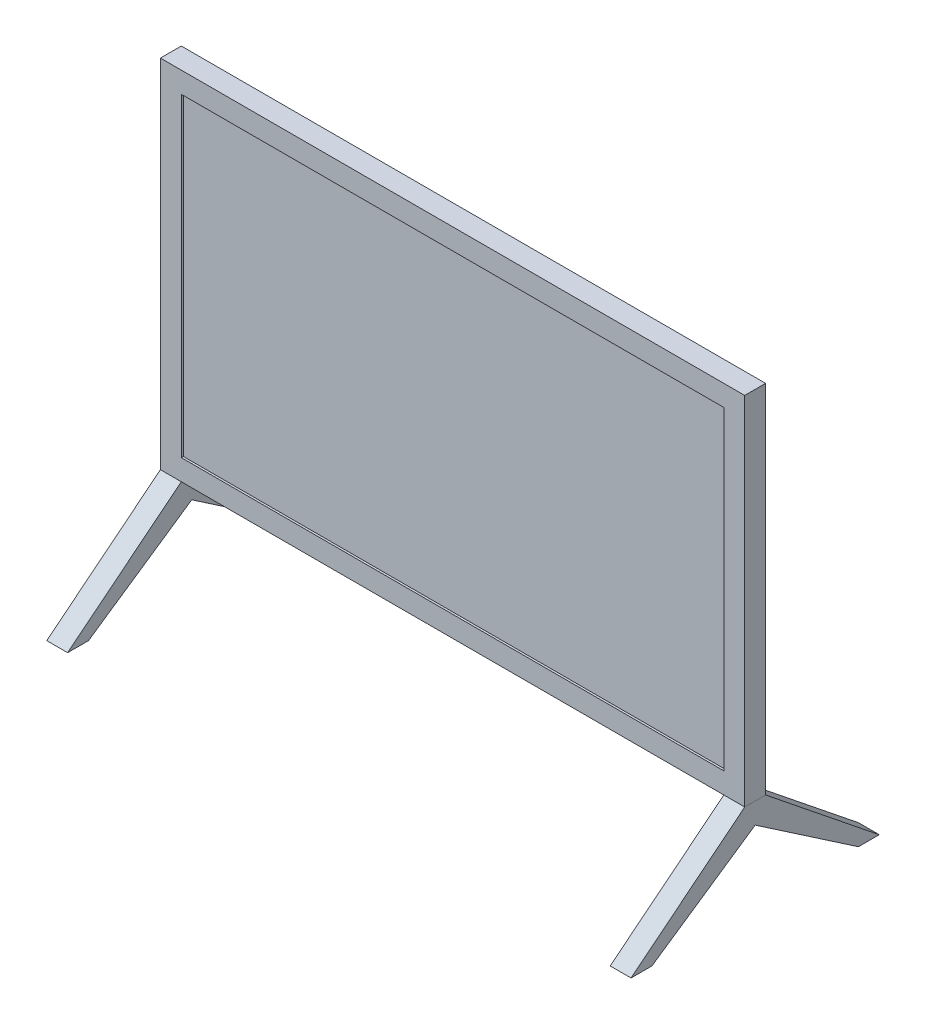
ISO-10303-21;
HEADER;
FILE_DESCRIPTION(('STEP AP214'),'2;1');
FILE_NAME('part.step','',(''),(''),'','','');
FILE_SCHEMA(('AUTOMOTIVE_DESIGN { 1 0 10303 214 1 1 1 1 }'));
ENDSEC;
DATA;
#1=APPLICATION_CONTEXT('core data for automotive mechanical design processes');
#2=APPLICATION_PROTOCOL_DEFINITION('international standard','automotive_design',2000,#1);
#3=PRODUCT_CONTEXT('',#1,'mechanical');
#4=PRODUCT('Part','Part','',(#3));
#5=PRODUCT_RELATED_PRODUCT_CATEGORY('part','',(#4));
#6=PRODUCT_DEFINITION_FORMATION('','',#4);
#7=PRODUCT_DEFINITION_CONTEXT('part definition',#1,'design');
#8=PRODUCT_DEFINITION('design','',#6,#7);
#9=PRODUCT_DEFINITION_SHAPE('','',#8);
#10=(LENGTH_UNIT() NAMED_UNIT(*) SI_UNIT(.MILLI.,.METRE.));
#11=(NAMED_UNIT(*) PLANE_ANGLE_UNIT() SI_UNIT($,.RADIAN.));
#12=(NAMED_UNIT(*) SI_UNIT($,.STERADIAN.) SOLID_ANGLE_UNIT());
#13=UNCERTAINTY_MEASURE_WITH_UNIT(LENGTH_MEASURE(1.E-05),#10,'distance_accuracy_value','');
#14=(GEOMETRIC_REPRESENTATION_CONTEXT(3) GLOBAL_UNCERTAINTY_ASSIGNED_CONTEXT((#13)) GLOBAL_UNIT_ASSIGNED_CONTEXT((#10,
#11,#12)) REPRESENTATION_CONTEXT('',''));
#15=CARTESIAN_POINT('',(0.,0.,0.));
#16=DIRECTION('',(0.,0.,1.));
#17=DIRECTION('',(1.,0.,0.));
#18=AXIS2_PLACEMENT_3D('',#15,#16,#17);
#19=CARTESIAN_POINT('',(0.,-20.3,0.));
#20=DIRECTION('',(0.,-1.,0.));
#21=DIRECTION('',(0.,0.,-1.));
#22=AXIS2_PLACEMENT_3D('',#19,#20,#21);
#23=PLANE('',#22);
#24=DIRECTION('',(0.,0.,1.));
#25=VECTOR('',#24,1.);
#26=CARTESIAN_POINT('',(20.3,-20.3,0.));
#27=LINE('',#26,#25);
#28=CARTESIAN_POINT('',(20.3,-20.3,0.));
#29=VERTEX_POINT('',#28);
#30=CARTESIAN_POINT('',(20.3,-20.3,20.3));
#31=VERTEX_POINT('',#30);
#32=EDGE_CURVE('E144',#29,#31,#27,.T.);
#33=ORIENTED_EDGE('',*,*,#32,.F.);
#34=DIRECTION('',(1.,0.,0.));
#35=VECTOR('',#34,1.);
#36=CARTESIAN_POINT('',(0.,-20.3,0.));
#37=LINE('',#36,#35);
#38=CARTESIAN_POINT('',(0.,-20.3,0.));
#39=VERTEX_POINT('',#38);
#40=EDGE_CURVE('E57',#39,#29,#37,.T.);
#41=ORIENTED_EDGE('',*,*,#40,.F.);
#42=DIRECTION('',(0.,0.,1.));
#43=VECTOR('',#42,1.);
#44=CARTESIAN_POINT('',(0.,-20.3,0.));
#45=LINE('',#44,#43);
#46=CARTESIAN_POINT('',(0.,-20.3,20.3));
#47=VERTEX_POINT('',#46);
#48=EDGE_CURVE('E157',#39,#47,#45,.T.);
#49=ORIENTED_EDGE('',*,*,#48,.T.);
#50=DIRECTION('',(1.,0.,0.));
#51=VECTOR('',#50,1.);
#52=CARTESIAN_POINT('',(0.,-20.3,20.3));
#53=LINE('',#52,#51);
#54=EDGE_CURVE('E12',#47,#31,#53,.T.);
#55=ORIENTED_EDGE('',*,*,#54,.T.);
#56=EDGE_LOOP('',(#33,#41,#49,#55));
#57=FACE_BOUND('',#56,.T.);
#58=ADVANCED_FACE('F54',(#57),#23,.F.);
#59=CARTESIAN_POINT('',(0.,-2.43598024801818,-1.95532524412434));
#60=DIRECTION('',(0.,-0.779846288570136,-0.625971058598865));
#61=DIRECTION('',(0.,0.625971058598865,-0.779846288570136));
#62=AXIS2_PLACEMENT_3D('',#59,#60,#61);
#63=PLANE('',#62);
#64=DIRECTION('',(0.,-0.625971058598865,0.779846288570136));
#65=VECTOR('',#64,1.);
#66=CARTESIAN_POINT('',(20.3,-2.43598024801818,-1.95532524412434));
#67=LINE('',#66,#65);
#68=CARTESIAN_POINT('',(20.3,-108.986074197332,130.786746728279));
#69=VERTEX_POINT('',#68);
#70=EDGE_CURVE('E104',#31,#69,#67,.T.);
#71=ORIENTED_EDGE('',*,*,#70,.F.);
#72=ORIENTED_EDGE('',*,*,#54,.F.);
#73=DIRECTION('',(0.,-0.625971058598865,0.779846288570136));
#74=VECTOR('',#73,1.);
#75=CARTESIAN_POINT('',(0.,-2.43598024801818,-1.95532524412434));
#76=LINE('',#75,#74);
#77=CARTESIAN_POINT('',(0.,-108.986074197332,130.786746728279));
#78=VERTEX_POINT('',#77);
#79=EDGE_CURVE('E72',#47,#78,#76,.T.);
#80=ORIENTED_EDGE('',*,*,#79,.T.);
#81=DIRECTION('',(1.,0.,0.));
#82=VECTOR('',#81,1.);
#83=CARTESIAN_POINT('',(0.,-108.986074197332,130.786746728279));
#84=LINE('',#83,#82);
#85=EDGE_CURVE('E63',#78,#69,#84,.T.);
#86=ORIENTED_EDGE('',*,*,#85,.T.);
#87=EDGE_LOOP('',(#71,#72,#80,#86));
#88=FACE_BOUND('',#87,.T.);
#89=ADVANCED_FACE('F191',(#88),#63,.F.);
#90=CARTESIAN_POINT('',(0.,-108.986074197332,0.));
#91=DIRECTION('',(0.,-1.,0.));
#92=DIRECTION('',(0.,0.,-1.));
#93=AXIS2_PLACEMENT_3D('',#90,#91,#92);
#94=PLANE('',#93);
#95=DIRECTION('',(0.,0.,1.));
#96=VECTOR('',#95,1.);
#97=CARTESIAN_POINT('',(20.3,-108.986074197332,0.));
#98=LINE('',#97,#96);
#99=CARTESIAN_POINT('',(20.3,-108.986074197332,110.486746728279));
#100=VERTEX_POINT('',#99);
#101=EDGE_CURVE('E98',#100,#69,#98,.T.);
#102=ORIENTED_EDGE('',*,*,#101,.T.);
#103=ORIENTED_EDGE('',*,*,#85,.F.);
#104=DIRECTION('',(0.,0.,1.));
#105=VECTOR('',#104,1.);
#106=CARTESIAN_POINT('',(0.,-108.986074197332,0.));
#107=LINE('',#106,#105);
#108=CARTESIAN_POINT('',(0.,-108.986074197332,110.486746728279));
#109=VERTEX_POINT('',#108);
#110=EDGE_CURVE('E126',#109,#78,#107,.T.);
#111=ORIENTED_EDGE('',*,*,#110,.F.);
#112=DIRECTION('',(1.,0.,0.));
#113=VECTOR('',#112,1.);
#114=CARTESIAN_POINT('',(0.,-108.986074197332,110.486746728279));
#115=LINE('',#114,#113);
#116=EDGE_CURVE('E133',#109,#100,#115,.T.);
#117=ORIENTED_EDGE('',*,*,#116,.T.);
#118=EDGE_LOOP('',(#102,#103,#111,#117));
#119=FACE_BOUND('',#118,.T.);
#120=ADVANCED_FACE('F139',(#119),#94,.T.);
#121=CARTESIAN_POINT('',(0.,-22.998553218572,-15.6750225427958));
#122=DIRECTION('',(0.,-0.826324478534592,-0.563194332512797));
#123=DIRECTION('',(0.,0.563194332512797,-0.826324478534592));
#124=AXIS2_PLACEMENT_3D('',#121,#122,#123);
#125=PLANE('',#124);
#126=DIRECTION('',(0.,-0.563194332512797,0.826324478534592));
#127=VECTOR('',#126,1.);
#128=CARTESIAN_POINT('',(20.3,-22.998553218572,-15.6750225427958));
#129=LINE('',#128,#127);
#130=CARTESIAN_POINT('',(20.3,-40.6,10.15));
#131=VERTEX_POINT('',#130);
#132=EDGE_CURVE('E136',#131,#100,#129,.T.);
#133=ORIENTED_EDGE('',*,*,#132,.T.);
#134=ORIENTED_EDGE('',*,*,#116,.F.);
#135=DIRECTION('',(0.,-0.563194332512797,0.826324478534592));
#136=VECTOR('',#135,1.);
#137=CARTESIAN_POINT('',(0.,-22.998553218572,-15.6750225427958));
#138=LINE('',#137,#136);
#139=CARTESIAN_POINT('',(0.,-40.6,10.15));
#140=VERTEX_POINT('',#139);
#141=EDGE_CURVE('E122',#140,#109,#138,.T.);
#142=ORIENTED_EDGE('',*,*,#141,.F.);
#143=DIRECTION('',(1.,0.,0.));
#144=VECTOR('',#143,1.);
#145=CARTESIAN_POINT('',(0.,-40.6,10.15));
#146=LINE('',#145,#144);
#147=EDGE_CURVE('E137',#140,#131,#146,.T.);
#148=ORIENTED_EDGE('',*,*,#147,.T.);
#149=EDGE_LOOP('',(#133,#134,#142,#148));
#150=FACE_BOUND('',#149,.T.);
#151=ADVANCED_FACE('F134',(#150),#125,.T.);
#152=CARTESIAN_POINT('',(0.,-32.4457928600557,22.1139360231389));
#153=DIRECTION('',(0.,0.826324478534592,-0.563194332512797));
#154=DIRECTION('',(0.,0.563194332512797,0.826324478534592));
#155=AXIS2_PLACEMENT_3D('',#152,#153,#154);
#156=PLANE('',#155);
#157=DIRECTION('',(0.,-0.563194332512797,-0.826324478534592));
#158=VECTOR('',#157,1.);
#159=CARTESIAN_POINT('',(20.3,-32.4457928600557,22.1139360231389));
#160=LINE('',#159,#158);
#161=CARTESIAN_POINT('',(20.3,-108.986074197332,-90.1867467282784));
#162=VERTEX_POINT('',#161);
#163=EDGE_CURVE('E152',#131,#162,#160,.T.);
#164=ORIENTED_EDGE('',*,*,#163,.F.);
#165=ORIENTED_EDGE('',*,*,#147,.F.);
#166=DIRECTION('',(0.,-0.563194332512797,-0.826324478534592));
#167=VECTOR('',#166,1.);
#168=CARTESIAN_POINT('',(0.,-32.4457928600557,22.1139360231389));
#169=LINE('',#168,#167);
#170=CARTESIAN_POINT('',(0.,-108.986074197332,-90.1867467282784));
#171=VERTEX_POINT('',#170);
#172=EDGE_CURVE('E128',#140,#171,#169,.T.);
#173=ORIENTED_EDGE('',*,*,#172,.T.);
#174=DIRECTION('',(1.,0.,0.));
#175=VECTOR('',#174,1.);
#176=CARTESIAN_POINT('',(0.,-108.986074197332,-90.1867467282784));
#177=LINE('',#176,#175);
#178=EDGE_CURVE('E161',#171,#162,#177,.T.);
#179=ORIENTED_EDGE('',*,*,#178,.T.);
#180=EDGE_LOOP('',(#164,#165,#173,#179));
#181=FACE_BOUND('',#180,.T.);
#182=ADVANCED_FACE('F177',(#181),#156,.F.);
#183=CARTESIAN_POINT('',(0.,-108.986074197332,0.));
#184=DIRECTION('',(0.,1.,0.));
#185=DIRECTION('',(0.,0.,1.));
#186=AXIS2_PLACEMENT_3D('',#183,#184,#185);
#187=PLANE('',#186);
#188=DIRECTION('',(0.,0.,-1.));
#189=VECTOR('',#188,1.);
#190=CARTESIAN_POINT('',(20.3,-108.986074197332,0.));
#191=LINE('',#190,#189);
#192=CARTESIAN_POINT('',(20.3,-108.986074197332,-110.486746728278));
#193=VERTEX_POINT('',#192);
#194=EDGE_CURVE('E149',#162,#193,#191,.T.);
#195=ORIENTED_EDGE('',*,*,#194,.F.);
#196=ORIENTED_EDGE('',*,*,#178,.F.);
#197=DIRECTION('',(0.,0.,-1.));
#198=VECTOR('',#197,1.);
#199=CARTESIAN_POINT('',(0.,-108.986074197332,0.));
#200=LINE('',#199,#198);
#201=CARTESIAN_POINT('',(0.,-108.986074197332,-110.486746728278));
#202=VERTEX_POINT('',#201);
#203=EDGE_CURVE('E178',#171,#202,#200,.T.);
#204=ORIENTED_EDGE('',*,*,#203,.T.);
#205=DIRECTION('',(1.,0.,0.));
#206=VECTOR('',#205,1.);
#207=CARTESIAN_POINT('',(0.,-108.986074197332,-110.486746728278));
#208=LINE('',#207,#206);
#209=EDGE_CURVE('E163',#202,#193,#208,.T.);
#210=ORIENTED_EDGE('',*,*,#209,.T.);
#211=EDGE_LOOP('',(#195,#196,#204,#210));
#212=FACE_BOUND('',#211,.T.);
#213=ADVANCED_FACE('F175',(#212),#187,.F.);
#214=CARTESIAN_POINT('',(0.,-12.3456527460713,9.90967249805308));
#215=DIRECTION('',(0.,0.779846288570136,-0.625971058598865));
#216=DIRECTION('',(0.,0.625971058598865,0.779846288570136));
#217=AXIS2_PLACEMENT_3D('',#214,#215,#216);
#218=PLANE('',#217);
#219=DIRECTION('',(0.,-0.625971058598865,-0.779846288570136));
#220=VECTOR('',#219,1.);
#221=CARTESIAN_POINT('',(20.3,-12.3456527460713,9.90967249805308));
#222=LINE('',#221,#220);
#223=EDGE_CURVE('E147',#29,#193,#222,.T.);
#224=ORIENTED_EDGE('',*,*,#223,.T.);
#225=ORIENTED_EDGE('',*,*,#209,.F.);
#226=DIRECTION('',(0.,-0.625971058598865,-0.779846288570136));
#227=VECTOR('',#226,1.);
#228=CARTESIAN_POINT('',(0.,-12.3456527460713,9.90967249805308));
#229=LINE('',#228,#227);
#230=EDGE_CURVE('E112',#39,#202,#229,.T.);
#231=ORIENTED_EDGE('',*,*,#230,.F.);
#232=ORIENTED_EDGE('',*,*,#40,.T.);
#233=EDGE_LOOP('',(#224,#225,#231,#232));
#234=FACE_BOUND('',#233,.T.);
#235=ADVANCED_FACE('F169',(#234),#218,.T.);
#236=CARTESIAN_POINT('',(0.,0.,0.));
#237=DIRECTION('',(1.,0.,0.));
#238=DIRECTION('',(0.,0.,1.));
#239=AXIS2_PLACEMENT_3D('',#236,#237,#238);
#240=PLANE('',#239);
#241=ORIENTED_EDGE('',*,*,#48,.F.);
#242=ORIENTED_EDGE('',*,*,#230,.T.);
#243=ORIENTED_EDGE('',*,*,#203,.F.);
#244=ORIENTED_EDGE('',*,*,#172,.F.);
#245=ORIENTED_EDGE('',*,*,#141,.T.);
#246=ORIENTED_EDGE('',*,*,#110,.T.);
#247=ORIENTED_EDGE('',*,*,#79,.F.);
#248=EDGE_LOOP('',(#241,#242,#243,#244,#245,#246,#247));
#249=FACE_BOUND('',#248,.T.);
#250=ADVANCED_FACE('F124',(#249),#240,.F.);
#251=CARTESIAN_POINT('',(20.3,0.,0.));
#252=DIRECTION('',(1.,0.,0.));
#253=DIRECTION('',(0.,0.,1.));
#254=AXIS2_PLACEMENT_3D('',#251,#252,#253);
#255=PLANE('',#254);
#256=ORIENTED_EDGE('',*,*,#32,.T.);
#257=ORIENTED_EDGE('',*,*,#70,.T.);
#258=ORIENTED_EDGE('',*,*,#101,.F.);
#259=ORIENTED_EDGE('',*,*,#132,.F.);
#260=ORIENTED_EDGE('',*,*,#163,.T.);
#261=ORIENTED_EDGE('',*,*,#194,.T.);
#262=ORIENTED_EDGE('',*,*,#223,.F.);
#263=EDGE_LOOP('',(#256,#257,#258,#259,#260,#261,#262));
#264=FACE_BOUND('',#263,.T.);
#265=ADVANCED_FACE('F173',(#264),#255,.T.);
#266=CLOSED_SHELL('',(#58,#89,#120,#151,#182,#213,#235,#250,#265));
#267=MANIFOLD_SOLID_BREP('B2',#266);
#268=CARTESIAN_POINT('',(-527.4,-20.3,0.));
#269=DIRECTION('',(0.,-1.,0.));
#270=DIRECTION('',(0.,0.,-1.));
#271=AXIS2_PLACEMENT_3D('',#268,#269,#270);
#272=PLANE('',#271);
#273=DIRECTION('',(0.,0.,1.));
#274=VECTOR('',#273,1.);
#275=CARTESIAN_POINT('',(-547.7,-20.3,0.));
#276=LINE('',#275,#274);
#277=CARTESIAN_POINT('',(-547.7,-20.3,0.));
#278=VERTEX_POINT('',#277);
#279=CARTESIAN_POINT('',(-547.7,-20.3,20.3));
#280=VERTEX_POINT('',#279);
#281=EDGE_CURVE('E364',#278,#280,#276,.T.);
#282=ORIENTED_EDGE('',*,*,#281,.T.);
#283=DIRECTION('',(-1.,0.,0.));
#284=VECTOR('',#283,1.);
#285=CARTESIAN_POINT('',(-527.4,-20.3,20.3));
#286=LINE('',#285,#284);
#287=CARTESIAN_POINT('',(-527.4,-20.3,20.3));
#288=VERTEX_POINT('',#287);
#289=EDGE_CURVE('E52',#288,#280,#286,.T.);
#290=ORIENTED_EDGE('',*,*,#289,.F.);
#291=DIRECTION('',(0.,0.,1.));
#292=VECTOR('',#291,1.);
#293=CARTESIAN_POINT('',(-527.4,-20.3,0.));
#294=LINE('',#293,#292);
#295=CARTESIAN_POINT('',(-527.4,-20.3,0.));
#296=VERTEX_POINT('',#295);
#297=EDGE_CURVE('E378',#296,#288,#294,.T.);
#298=ORIENTED_EDGE('',*,*,#297,.F.);
#299=DIRECTION('',(-1.,0.,0.));
#300=VECTOR('',#299,1.);
#301=CARTESIAN_POINT('',(-527.4,-20.3,0.));
#302=LINE('',#301,#300);
#303=EDGE_CURVE('E277',#296,#278,#302,.T.);
#304=ORIENTED_EDGE('',*,*,#303,.T.);
#305=EDGE_LOOP('',(#282,#290,#298,#304));
#306=FACE_BOUND('',#305,.T.);
#307=ADVANCED_FACE('F274',(#306),#272,.F.);
#308=CARTESIAN_POINT('',(-527.4,-2.43598024801818,-1.95532524412434));
#309=DIRECTION('',(0.,-0.779846288570136,-0.625971058598865));
#310=DIRECTION('',(0.,0.625971058598865,-0.779846288570136));
#311=AXIS2_PLACEMENT_3D('',#308,#309,#310);
#312=PLANE('',#311);
#313=DIRECTION('',(0.,-0.625971058598865,0.779846288570136));
#314=VECTOR('',#313,1.);
#315=CARTESIAN_POINT('',(-547.7,-2.43598024801818,-1.95532524412434));
#316=LINE('',#315,#314);
#317=CARTESIAN_POINT('',(-547.7,-108.986074197332,130.786746728279));
#318=VERTEX_POINT('',#317);
#319=EDGE_CURVE('E322',#280,#318,#316,.T.);
#320=ORIENTED_EDGE('',*,*,#319,.T.);
#321=DIRECTION('',(-1.,0.,0.));
#322=VECTOR('',#321,1.);
#323=CARTESIAN_POINT('',(-527.4,-108.986074197332,130.786746728279));
#324=LINE('',#323,#322);
#325=CARTESIAN_POINT('',(-527.4,-108.986074197332,130.786746728279));
#326=VERTEX_POINT('',#325);
#327=EDGE_CURVE('E283',#326,#318,#324,.T.);
#328=ORIENTED_EDGE('',*,*,#327,.F.);
#329=DIRECTION('',(0.,-0.625971058598865,0.779846288570136));
#330=VECTOR('',#329,1.);
#331=CARTESIAN_POINT('',(-527.4,-2.43598024801818,-1.95532524412434));
#332=LINE('',#331,#330);
#333=EDGE_CURVE('E291',#288,#326,#332,.T.);
#334=ORIENTED_EDGE('',*,*,#333,.F.);
#335=ORIENTED_EDGE('',*,*,#289,.T.);
#336=EDGE_LOOP('',(#320,#328,#334,#335));
#337=FACE_BOUND('',#336,.T.);
#338=ADVANCED_FACE('F403',(#337),#312,.F.);
#339=CARTESIAN_POINT('',(-527.4,-108.986074197332,0.));
#340=DIRECTION('',(0.,-1.,0.));
#341=DIRECTION('',(0.,0.,-1.));
#342=AXIS2_PLACEMENT_3D('',#339,#340,#341);
#343=PLANE('',#342);
#344=DIRECTION('',(0.,0.,1.));
#345=VECTOR('',#344,1.);
#346=CARTESIAN_POINT('',(-547.7,-108.986074197332,0.));
#347=LINE('',#346,#345);
#348=CARTESIAN_POINT('',(-547.7,-108.986074197332,110.486746728279));
#349=VERTEX_POINT('',#348);
#350=EDGE_CURVE('E343',#349,#318,#347,.T.);
#351=ORIENTED_EDGE('',*,*,#350,.F.);
#352=DIRECTION('',(-1.,0.,0.));
#353=VECTOR('',#352,1.);
#354=CARTESIAN_POINT('',(-527.4,-108.986074197332,110.486746728279));
#355=LINE('',#354,#353);
#356=CARTESIAN_POINT('',(-527.4,-108.986074197332,110.486746728279));
#357=VERTEX_POINT('',#356);
#358=EDGE_CURVE('E339',#357,#349,#355,.T.);
#359=ORIENTED_EDGE('',*,*,#358,.F.);
#360=DIRECTION('',(0.,0.,1.));
#361=VECTOR('',#360,1.);
#362=CARTESIAN_POINT('',(-527.4,-108.986074197332,0.));
#363=LINE('',#362,#361);
#364=EDGE_CURVE('E342',#357,#326,#363,.T.);
#365=ORIENTED_EDGE('',*,*,#364,.T.);
#366=ORIENTED_EDGE('',*,*,#327,.T.);
#367=EDGE_LOOP('',(#351,#359,#365,#366));
#368=FACE_BOUND('',#367,.T.);
#369=ADVANCED_FACE('F341',(#368),#343,.T.);
#370=CARTESIAN_POINT('',(-527.4,-22.998553218572,-15.6750225427958));
#371=DIRECTION('',(0.,-0.826324478534592,-0.563194332512797));
#372=DIRECTION('',(0.,0.563194332512797,-0.826324478534592));
#373=AXIS2_PLACEMENT_3D('',#370,#371,#372);
#374=PLANE('',#373);
#375=DIRECTION('',(0.,-0.563194332512797,0.826324478534592));
#376=VECTOR('',#375,1.);
#377=CARTESIAN_POINT('',(-547.7,-22.998553218572,-15.6750225427958));
#378=LINE('',#377,#376);
#379=CARTESIAN_POINT('',(-547.7,-40.6,10.15));
#380=VERTEX_POINT('',#379);
#381=EDGE_CURVE('E375',#380,#349,#378,.T.);
#382=ORIENTED_EDGE('',*,*,#381,.F.);
#383=DIRECTION('',(-1.,0.,0.));
#384=VECTOR('',#383,1.);
#385=CARTESIAN_POINT('',(-527.4,-40.6,10.15));
#386=LINE('',#385,#384);
#387=CARTESIAN_POINT('',(-527.4,-40.6,10.15));
#388=VERTEX_POINT('',#387);
#389=EDGE_CURVE('E348',#388,#380,#386,.T.);
#390=ORIENTED_EDGE('',*,*,#389,.F.);
#391=DIRECTION('',(0.,-0.563194332512797,0.826324478534592));
#392=VECTOR('',#391,1.);
#393=CARTESIAN_POINT('',(-527.4,-22.998553218572,-15.6750225427958));
#394=LINE('',#393,#392);
#395=EDGE_CURVE('E353',#388,#357,#394,.T.);
#396=ORIENTED_EDGE('',*,*,#395,.T.);
#397=ORIENTED_EDGE('',*,*,#358,.T.);
#398=EDGE_LOOP('',(#382,#390,#396,#397));
#399=FACE_BOUND('',#398,.T.);
#400=ADVANCED_FACE('F355',(#399),#374,.T.);
#401=CARTESIAN_POINT('',(-527.4,-32.4457928600557,22.1139360231389));
#402=DIRECTION('',(0.,0.826324478534592,-0.563194332512797));
#403=DIRECTION('',(0.,0.563194332512797,0.826324478534592));
#404=AXIS2_PLACEMENT_3D('',#401,#402,#403);
#405=PLANE('',#404);
#406=DIRECTION('',(0.,-0.563194332512797,-0.826324478534592));
#407=VECTOR('',#406,1.);
#408=CARTESIAN_POINT('',(-547.7,-32.4457928600557,22.1139360231389));
#409=LINE('',#408,#407);
#410=CARTESIAN_POINT('',(-547.7,-108.986074197332,-90.1867467282784));
#411=VERTEX_POINT('',#410);
#412=EDGE_CURVE('E373',#380,#411,#409,.T.);
#413=ORIENTED_EDGE('',*,*,#412,.T.);
#414=DIRECTION('',(-1.,0.,0.));
#415=VECTOR('',#414,1.);
#416=CARTESIAN_POINT('',(-527.4,-108.986074197332,-90.1867467282784));
#417=LINE('',#416,#415);
#418=CARTESIAN_POINT('',(-527.4,-108.986074197332,-90.1867467282784));
#419=VERTEX_POINT('',#418);
#420=EDGE_CURVE('E382',#419,#411,#417,.T.);
#421=ORIENTED_EDGE('',*,*,#420,.F.);
#422=DIRECTION('',(0.,-0.563194332512797,-0.826324478534592));
#423=VECTOR('',#422,1.);
#424=CARTESIAN_POINT('',(-527.4,-32.4457928600557,22.1139360231389));
#425=LINE('',#424,#423);
#426=EDGE_CURVE('E357',#388,#419,#425,.T.);
#427=ORIENTED_EDGE('',*,*,#426,.F.);
#428=ORIENTED_EDGE('',*,*,#389,.T.);
#429=EDGE_LOOP('',(#413,#421,#427,#428));
#430=FACE_BOUND('',#429,.T.);
#431=ADVANCED_FACE('F399',(#430),#405,.F.);
#432=CARTESIAN_POINT('',(-527.4,-108.986074197332,0.));
#433=DIRECTION('',(0.,1.,0.));
#434=DIRECTION('',(0.,0.,1.));
#435=AXIS2_PLACEMENT_3D('',#432,#433,#434);
#436=PLANE('',#435);
#437=DIRECTION('',(0.,0.,-1.));
#438=VECTOR('',#437,1.);
#439=CARTESIAN_POINT('',(-547.7,-108.986074197332,0.));
#440=LINE('',#439,#438);
#441=CARTESIAN_POINT('',(-547.7,-108.986074197332,-110.486746728278));
#442=VERTEX_POINT('',#441);
#443=EDGE_CURVE('E370',#411,#442,#440,.T.);
#444=ORIENTED_EDGE('',*,*,#443,.T.);
#445=DIRECTION('',(-1.,0.,0.));
#446=VECTOR('',#445,1.);
#447=CARTESIAN_POINT('',(-527.4,-108.986074197332,-110.486746728278));
#448=LINE('',#447,#446);
#449=CARTESIAN_POINT('',(-527.4,-108.986074197332,-110.486746728278));
#450=VERTEX_POINT('',#449);
#451=EDGE_CURVE('E384',#450,#442,#448,.T.);
#452=ORIENTED_EDGE('',*,*,#451,.F.);
#453=DIRECTION('',(0.,0.,-1.));
#454=VECTOR('',#453,1.);
#455=CARTESIAN_POINT('',(-527.4,-108.986074197332,0.));
#456=LINE('',#455,#454);
#457=EDGE_CURVE('E359',#419,#450,#456,.T.);
#458=ORIENTED_EDGE('',*,*,#457,.F.);
#459=ORIENTED_EDGE('',*,*,#420,.T.);
#460=EDGE_LOOP('',(#444,#452,#458,#459));
#461=FACE_BOUND('',#460,.T.);
#462=ADVANCED_FACE('F393',(#461),#436,.F.);
#463=CARTESIAN_POINT('',(-527.4,-12.3456527460713,9.90967249805308));
#464=DIRECTION('',(0.,0.779846288570136,-0.625971058598865));
#465=DIRECTION('',(0.,0.625971058598865,0.779846288570136));
#466=AXIS2_PLACEMENT_3D('',#463,#464,#465);
#467=PLANE('',#466);
#468=DIRECTION('',(0.,-0.625971058598865,-0.779846288570136));
#469=VECTOR('',#468,1.);
#470=CARTESIAN_POINT('',(-547.7,-12.3456527460713,9.90967249805308));
#471=LINE('',#470,#469);
#472=EDGE_CURVE('E367',#278,#442,#471,.T.);
#473=ORIENTED_EDGE('',*,*,#472,.F.);
#474=ORIENTED_EDGE('',*,*,#303,.F.);
#475=DIRECTION('',(0.,-0.625971058598865,-0.779846288570136));
#476=VECTOR('',#475,1.);
#477=CARTESIAN_POINT('',(-527.4,-12.3456527460713,9.90967249805308));
#478=LINE('',#477,#476);
#479=EDGE_CURVE('E423',#296,#450,#478,.T.);
#480=ORIENTED_EDGE('',*,*,#479,.T.);
#481=ORIENTED_EDGE('',*,*,#451,.T.);
#482=EDGE_LOOP('',(#473,#474,#480,#481));
#483=FACE_BOUND('',#482,.T.);
#484=ADVANCED_FACE('F391',(#483),#467,.T.);
#485=CARTESIAN_POINT('',(-527.4,0.,0.));
#486=DIRECTION('',(-1.,0.,0.));
#487=DIRECTION('',(0.,0.,1.));
#488=AXIS2_PLACEMENT_3D('',#485,#486,#487);
#489=PLANE('',#488);
#490=ORIENTED_EDGE('',*,*,#297,.T.);
#491=ORIENTED_EDGE('',*,*,#333,.T.);
#492=ORIENTED_EDGE('',*,*,#364,.F.);
#493=ORIENTED_EDGE('',*,*,#395,.F.);
#494=ORIENTED_EDGE('',*,*,#426,.T.);
#495=ORIENTED_EDGE('',*,*,#457,.T.);
#496=ORIENTED_EDGE('',*,*,#479,.F.);
#497=EDGE_LOOP('',(#490,#491,#492,#493,#494,#495,#496));
#498=FACE_BOUND('',#497,.T.);
#499=ADVANCED_FACE('F352',(#498),#489,.F.);
#500=CARTESIAN_POINT('',(-547.7,0.,0.));
#501=DIRECTION('',(-1.,0.,0.));
#502=DIRECTION('',(0.,0.,1.));
#503=AXIS2_PLACEMENT_3D('',#500,#501,#502);
#504=PLANE('',#503);
#505=ORIENTED_EDGE('',*,*,#281,.F.);
#506=ORIENTED_EDGE('',*,*,#472,.T.);
#507=ORIENTED_EDGE('',*,*,#443,.F.);
#508=ORIENTED_EDGE('',*,*,#412,.F.);
#509=ORIENTED_EDGE('',*,*,#381,.T.);
#510=ORIENTED_EDGE('',*,*,#350,.T.);
#511=ORIENTED_EDGE('',*,*,#319,.F.);
#512=EDGE_LOOP('',(#505,#506,#507,#508,#509,#510,#511));
#513=FACE_BOUND('',#512,.T.);
#514=ADVANCED_FACE('F389',(#513),#504,.T.);
#515=CLOSED_SHELL('',(#307,#338,#369,#400,#431,#462,#484,#499,#514));
#516=MANIFOLD_SOLID_BREP('B6',#515);
#517=CARTESIAN_POINT('',(0.,0.,20.3));
#518=DIRECTION('',(-1.,0.,0.));
#519=DIRECTION('',(0.,-1.,0.));
#520=AXIS2_PLACEMENT_3D('',#517,#518,#519);
#521=PLANE('',#520);
#522=DIRECTION('',(0.,0.,-1.));
#523=VECTOR('',#522,1.);
#524=CARTESIAN_POINT('',(0.,305.913925802668,20.3));
#525=LINE('',#524,#523);
#526=CARTESIAN_POINT('',(0.,305.913925802668,20.3));
#527=VERTEX_POINT('',#526);
#528=CARTESIAN_POINT('',(0.,305.913925802668,18.3));
#529=VERTEX_POINT('',#528);
#530=EDGE_CURVE('E562',#527,#529,#525,.T.);
#531=ORIENTED_EDGE('',*,*,#530,.T.);
#532=DIRECTION('',(0.,-1.,0.));
#533=VECTOR('',#532,1.);
#534=CARTESIAN_POINT('',(0.,326.215925802668,18.3));
#535=LINE('',#534,#533);
#536=CARTESIAN_POINT('',(0.,0.,18.3));
#537=VERTEX_POINT('',#536);
#538=EDGE_CURVE('E548',#529,#537,#535,.T.);
#539=ORIENTED_EDGE('',*,*,#538,.T.);
#540=DIRECTION('',(0.,0.,-1.));
#541=VECTOR('',#540,1.);
#542=CARTESIAN_POINT('',(0.,0.,20.3));
#543=LINE('',#542,#541);
#544=CARTESIAN_POINT('',(0.,0.,20.3));
#545=VERTEX_POINT('',#544);
#546=EDGE_CURVE('E655',#545,#537,#543,.T.);
#547=ORIENTED_EDGE('',*,*,#546,.F.);
#548=DIRECTION('',(0.,1.,0.));
#549=VECTOR('',#548,1.);
#550=CARTESIAN_POINT('',(0.,0.,20.3));
#551=LINE('',#550,#549);
#552=EDGE_CURVE('E568',#545,#527,#551,.T.);
#553=ORIENTED_EDGE('',*,*,#552,.T.);
#554=EDGE_LOOP('',(#531,#539,#547,#553));
#555=FACE_BOUND('',#554,.T.);
#556=ADVANCED_FACE('F485',(#555),#521,.T.);
#557=CARTESIAN_POINT('',(0.,305.913925802668,20.3));
#558=DIRECTION('',(0.,-1.,0.));
#559=DIRECTION('',(1.,0.,0.));
#560=AXIS2_PLACEMENT_3D('',#557,#558,#559);
#561=PLANE('',#560);
#562=DIRECTION('',(0.,0.,-1.));
#563=VECTOR('',#562,1.);
#564=CARTESIAN_POINT('',(-527.4,305.913925802668,20.3));
#565=LINE('',#564,#563);
#566=CARTESIAN_POINT('',(-527.4,305.913925802668,20.3));
#567=VERTEX_POINT('',#566);
#568=CARTESIAN_POINT('',(-527.4,305.913925802668,18.3));
#569=VERTEX_POINT('',#568);
#570=EDGE_CURVE('E565',#567,#569,#565,.T.);
#571=ORIENTED_EDGE('',*,*,#570,.T.);
#572=DIRECTION('',(-1.,0.,0.));
#573=VECTOR('',#572,1.);
#574=CARTESIAN_POINT('',(-527.4,305.913925802668,18.3));
#575=LINE('',#574,#573);
#576=EDGE_CURVE('E551',#529,#569,#575,.T.);
#577=ORIENTED_EDGE('',*,*,#576,.F.);
#578=ORIENTED_EDGE('',*,*,#530,.F.);
#579=DIRECTION('',(-1.,0.,0.));
#580=VECTOR('',#579,1.);
#581=CARTESIAN_POINT('',(0.,305.913925802668,20.3));
#582=LINE('',#581,#580);
#583=EDGE_CURVE('E661',#527,#567,#582,.T.);
#584=ORIENTED_EDGE('',*,*,#583,.T.);
#585=EDGE_LOOP('',(#571,#577,#578,#584));
#586=FACE_BOUND('',#585,.T.);
#587=ADVANCED_FACE('F561',(#586),#561,.T.);
#588=CARTESIAN_POINT('',(-527.4,0.,20.3));
#589=DIRECTION('',(1.,0.,0.));
#590=DIRECTION('',(0.,1.,0.));
#591=AXIS2_PLACEMENT_3D('',#588,#589,#590);
#592=PLANE('',#591);
#593=DIRECTION('',(0.,0.,-1.));
#594=VECTOR('',#593,1.);
#595=CARTESIAN_POINT('',(-527.4,0.,20.3));
#596=LINE('',#595,#594);
#597=CARTESIAN_POINT('',(-527.4,0.,20.3));
#598=VERTEX_POINT('',#597);
#599=CARTESIAN_POINT('',(-527.4,0.,18.3));
#600=VERTEX_POINT('',#599);
#601=EDGE_CURVE('E507',#598,#600,#596,.T.);
#602=ORIENTED_EDGE('',*,*,#601,.T.);
#603=DIRECTION('',(0.,-1.,0.));
#604=VECTOR('',#603,1.);
#605=CARTESIAN_POINT('',(-527.4,326.215925802668,18.3));
#606=LINE('',#605,#604);
#607=EDGE_CURVE('E500',#569,#600,#606,.T.);
#608=ORIENTED_EDGE('',*,*,#607,.F.);
#609=ORIENTED_EDGE('',*,*,#570,.F.);
#610=DIRECTION('',(0.,-1.,0.));
#611=VECTOR('',#610,1.);
#612=CARTESIAN_POINT('',(-527.4,0.,20.3));
#613=LINE('',#612,#611);
#614=EDGE_CURVE('E653',#567,#598,#613,.T.);
#615=ORIENTED_EDGE('',*,*,#614,.T.);
#616=EDGE_LOOP('',(#602,#608,#609,#615));
#617=FACE_BOUND('',#616,.T.);
#618=ADVANCED_FACE('F631',(#617),#592,.T.);
#619=CARTESIAN_POINT('',(0.,0.,20.3));
#620=DIRECTION('',(0.,1.,0.));
#621=DIRECTION('',(-1.,0.,0.));
#622=AXIS2_PLACEMENT_3D('',#619,#620,#621);
#623=PLANE('',#622);
#624=ORIENTED_EDGE('',*,*,#546,.T.);
#625=DIRECTION('',(1.,0.,0.));
#626=VECTOR('',#625,1.);
#627=CARTESIAN_POINT('',(-527.4,0.,18.3));
#628=LINE('',#627,#626);
#629=EDGE_CURVE('E552',#600,#537,#628,.T.);
#630=ORIENTED_EDGE('',*,*,#629,.F.);
#631=ORIENTED_EDGE('',*,*,#601,.F.);
#632=DIRECTION('',(1.,0.,0.));
#633=VECTOR('',#632,1.);
#634=CARTESIAN_POINT('',(0.,0.,20.3));
#635=LINE('',#634,#633);
#636=EDGE_CURVE('E656',#598,#545,#635,.T.);
#637=ORIENTED_EDGE('',*,*,#636,.T.);
#638=EDGE_LOOP('',(#624,#630,#631,#637));
#639=FACE_BOUND('',#638,.T.);
#640=ADVANCED_FACE('F637',(#639),#623,.T.);
#641=CARTESIAN_POINT('',(0.,0.,20.3));
#642=DIRECTION('',(0.,0.,1.));
#643=DIRECTION('',(1.,0.,0.));
#644=AXIS2_PLACEMENT_3D('',#641,#642,#643);
#645=PLANE('',#644);
#646=DIRECTION('',(0.,-1.,0.));
#647=VECTOR('',#646,1.);
#648=CARTESIAN_POINT('',(-547.7,-20.3,20.3));
#649=LINE('',#648,#647);
#650=CARTESIAN_POINT('',(-547.7,326.213925802668,20.3));
#651=VERTEX_POINT('',#650);
#652=CARTESIAN_POINT('',(-547.7,-20.3,20.3));
#653=VERTEX_POINT('',#652);
#654=EDGE_CURVE('E577',#651,#653,#649,.T.);
#655=ORIENTED_EDGE('',*,*,#654,.T.);
#656=DIRECTION('',(1.,0.,0.));
#657=VECTOR('',#656,1.);
#658=CARTESIAN_POINT('',(20.3,-20.3,20.3));
#659=LINE('',#658,#657);
#660=CARTESIAN_POINT('',(20.3,-20.3,20.3));
#661=VERTEX_POINT('',#660);
#662=EDGE_CURVE('E580',#653,#661,#659,.T.);
#663=ORIENTED_EDGE('',*,*,#662,.T.);
#664=DIRECTION('',(0.,1.,0.));
#665=VECTOR('',#664,1.);
#666=CARTESIAN_POINT('',(20.3,-20.3,20.3));
#667=LINE('',#666,#665);
#668=CARTESIAN_POINT('',(20.3,326.213925802668,20.3));
#669=VERTEX_POINT('',#668);
#670=EDGE_CURVE('E583',#661,#669,#667,.T.);
#671=ORIENTED_EDGE('',*,*,#670,.T.);
#672=DIRECTION('',(-1.,0.,0.));
#673=VECTOR('',#672,1.);
#674=CARTESIAN_POINT('',(20.3,326.213925802668,20.3));
#675=LINE('',#674,#673);
#676=EDGE_CURVE('E585',#669,#651,#675,.T.);
#677=ORIENTED_EDGE('',*,*,#676,.T.);
#678=EDGE_LOOP('',(#655,#663,#671,#677));
#679=FACE_BOUND('',#678,.T.);
#680=ORIENTED_EDGE('',*,*,#583,.F.);
#681=ORIENTED_EDGE('',*,*,#552,.F.);
#682=ORIENTED_EDGE('',*,*,#636,.F.);
#683=ORIENTED_EDGE('',*,*,#614,.F.);
#684=EDGE_LOOP('',(#680,#681,#682,#683));
#685=FACE_BOUND('',#684,.T.);
#686=ADVANCED_FACE('F616',(#679,#685),#645,.T.);
#687=CARTESIAN_POINT('',(0.,0.,0.));
#688=DIRECTION('',(0.,0.,1.));
#689=DIRECTION('',(1.,0.,0.));
#690=AXIS2_PLACEMENT_3D('',#687,#688,#689);
#691=PLANE('',#690);
#692=DIRECTION('',(0.,-1.,0.));
#693=VECTOR('',#692,1.);
#694=CARTESIAN_POINT('',(-547.7,-20.3,0.));
#695=LINE('',#694,#693);
#696=CARTESIAN_POINT('',(-547.7,326.213925802668,0.));
#697=VERTEX_POINT('',#696);
#698=CARTESIAN_POINT('',(-547.7,-20.3,0.));
#699=VERTEX_POINT('',#698);
#700=EDGE_CURVE('E569',#697,#699,#695,.T.);
#701=ORIENTED_EDGE('',*,*,#700,.F.);
#702=DIRECTION('',(-1.,0.,0.));
#703=VECTOR('',#702,1.);
#704=CARTESIAN_POINT('',(20.3,326.213925802668,0.));
#705=LINE('',#704,#703);
#706=CARTESIAN_POINT('',(20.3,326.213925802668,0.));
#707=VERTEX_POINT('',#706);
#708=EDGE_CURVE('E581',#707,#697,#705,.T.);
#709=ORIENTED_EDGE('',*,*,#708,.F.);
#710=DIRECTION('',(0.,1.,0.));
#711=VECTOR('',#710,1.);
#712=CARTESIAN_POINT('',(20.3,-20.3,0.));
#713=LINE('',#712,#711);
#714=CARTESIAN_POINT('',(20.3,-20.3,0.));
#715=VERTEX_POINT('',#714);
#716=EDGE_CURVE('E589',#715,#707,#713,.T.);
#717=ORIENTED_EDGE('',*,*,#716,.F.);
#718=DIRECTION('',(1.,0.,0.));
#719=VECTOR('',#718,1.);
#720=CARTESIAN_POINT('',(20.3,-20.3,0.));
#721=LINE('',#720,#719);
#722=EDGE_CURVE('E572',#699,#715,#721,.T.);
#723=ORIENTED_EDGE('',*,*,#722,.F.);
#724=EDGE_LOOP('',(#701,#709,#717,#723));
#725=FACE_BOUND('',#724,.T.);
#726=ADVANCED_FACE('F607',(#725),#691,.F.);
#727=CARTESIAN_POINT('',(-547.7,-20.3,20.3));
#728=DIRECTION('',(1.,0.,0.));
#729=DIRECTION('',(0.,0.,-1.));
#730=AXIS2_PLACEMENT_3D('',#727,#728,#729);
#731=PLANE('',#730);
#732=ORIENTED_EDGE('',*,*,#700,.T.);
#733=DIRECTION('',(0.,0.,-1.));
#734=VECTOR('',#733,1.);
#735=CARTESIAN_POINT('',(-547.7,-20.3,20.3));
#736=LINE('',#735,#734);
#737=EDGE_CURVE('E272',#653,#699,#736,.T.);
#738=ORIENTED_EDGE('',*,*,#737,.F.);
#739=ORIENTED_EDGE('',*,*,#654,.F.);
#740=DIRECTION('',(0.,0.,-1.));
#741=VECTOR('',#740,1.);
#742=CARTESIAN_POINT('',(-547.7,326.213925802668,20.3));
#743=LINE('',#742,#741);
#744=EDGE_CURVE('E586',#651,#697,#743,.T.);
#745=ORIENTED_EDGE('',*,*,#744,.T.);
#746=EDGE_LOOP('',(#732,#738,#739,#745));
#747=FACE_BOUND('',#746,.T.);
#748=ADVANCED_FACE('F487',(#747),#731,.F.);
#749=CARTESIAN_POINT('',(20.3,-20.3,20.3));
#750=DIRECTION('',(0.,1.,0.));
#751=DIRECTION('',(0.,0.,1.));
#752=AXIS2_PLACEMENT_3D('',#749,#750,#751);
#753=PLANE('',#752);
#754=ORIENTED_EDGE('',*,*,#722,.T.);
#755=DIRECTION('',(0.,0.,-1.));
#756=VECTOR('',#755,1.);
#757=CARTESIAN_POINT('',(20.3,-20.3,20.3));
#758=LINE('',#757,#756);
#759=EDGE_CURVE('E493',#661,#715,#758,.T.);
#760=ORIENTED_EDGE('',*,*,#759,.F.);
#761=ORIENTED_EDGE('',*,*,#662,.F.);
#762=ORIENTED_EDGE('',*,*,#737,.T.);
#763=EDGE_LOOP('',(#754,#760,#761,#762));
#764=FACE_BOUND('',#763,.T.);
#765=ADVANCED_FACE('F618',(#764),#753,.F.);
#766=CARTESIAN_POINT('',(20.3,-20.3,20.3));
#767=DIRECTION('',(-1.,0.,0.));
#768=DIRECTION('',(0.,0.,1.));
#769=AXIS2_PLACEMENT_3D('',#766,#767,#768);
#770=PLANE('',#769);
#771=ORIENTED_EDGE('',*,*,#716,.T.);
#772=DIRECTION('',(0.,0.,-1.));
#773=VECTOR('',#772,1.);
#774=CARTESIAN_POINT('',(20.3,326.213925802668,20.3));
#775=LINE('',#774,#773);
#776=EDGE_CURVE('E594',#669,#707,#775,.T.);
#777=ORIENTED_EDGE('',*,*,#776,.F.);
#778=ORIENTED_EDGE('',*,*,#670,.F.);
#779=ORIENTED_EDGE('',*,*,#759,.T.);
#780=EDGE_LOOP('',(#771,#777,#778,#779));
#781=FACE_BOUND('',#780,.T.);
#782=ADVANCED_FACE('F601',(#781),#770,.F.);
#783=CARTESIAN_POINT('',(20.3,326.213925802668,20.3));
#784=DIRECTION('',(0.,-1.,0.));
#785=DIRECTION('',(0.,0.,-1.));
#786=AXIS2_PLACEMENT_3D('',#783,#784,#785);
#787=PLANE('',#786);
#788=ORIENTED_EDGE('',*,*,#708,.T.);
#789=ORIENTED_EDGE('',*,*,#744,.F.);
#790=ORIENTED_EDGE('',*,*,#676,.F.);
#791=ORIENTED_EDGE('',*,*,#776,.T.);
#792=EDGE_LOOP('',(#788,#789,#790,#791));
#793=FACE_BOUND('',#792,.T.);
#794=ADVANCED_FACE('F610',(#793),#787,.F.);
#795=CARTESIAN_POINT('',(-527.4,326.215925802668,18.3));
#796=DIRECTION('',(0.,0.,-1.));
#797=DIRECTION('',(-1.,0.,0.));
#798=AXIS2_PLACEMENT_3D('',#795,#796,#797);
#799=PLANE('',#798);
#800=ORIENTED_EDGE('',*,*,#538,.F.);
#801=ORIENTED_EDGE('',*,*,#576,.T.);
#802=ORIENTED_EDGE('',*,*,#607,.T.);
#803=ORIENTED_EDGE('',*,*,#629,.T.);
#804=EDGE_LOOP('',(#800,#801,#802,#803));
#805=FACE_BOUND('',#804,.T.);
#806=ADVANCED_FACE('F550',(#805),#799,.F.);
#807=CLOSED_SHELL('',(#556,#587,#618,#640,#686,#726,#748,#765,#782,#794,#806));
#808=MANIFOLD_SOLID_BREP('B46',#807);
#809=ADVANCED_BREP_SHAPE_REPRESENTATION('',(#18,#267,#516,#808),#14);
#810=SHAPE_DEFINITION_REPRESENTATION(#9,#809);
ENDSEC;
END-ISO-10303-21;
